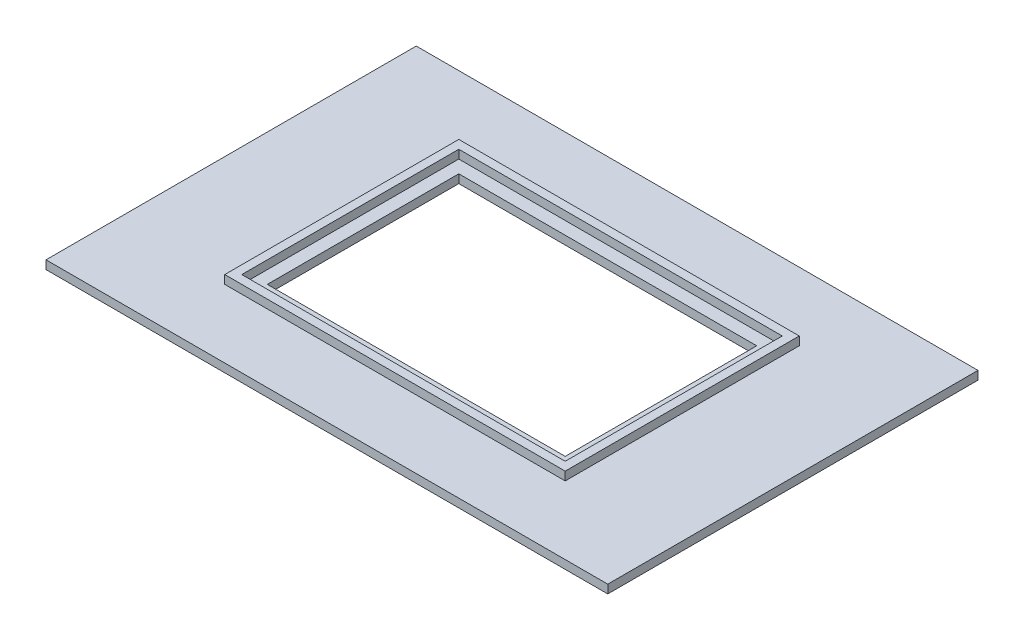
ISO-10303-21;
HEADER;
FILE_DESCRIPTION(('STEP AP214'),'2;1');
FILE_NAME('part.step','',(''),(''),'','','');
FILE_SCHEMA(('AUTOMOTIVE_DESIGN { 1 0 10303 214 1 1 1 1 }'));
ENDSEC;
DATA;
#1=APPLICATION_CONTEXT('core data for automotive mechanical design processes');
#2=APPLICATION_PROTOCOL_DEFINITION('international standard','automotive_design',2000,#1);
#3=PRODUCT_CONTEXT('',#1,'mechanical');
#4=PRODUCT('Part','Part','',(#3));
#5=PRODUCT_RELATED_PRODUCT_CATEGORY('part','',(#4));
#6=PRODUCT_DEFINITION_FORMATION('','',#4);
#7=PRODUCT_DEFINITION_CONTEXT('part definition',#1,'design');
#8=PRODUCT_DEFINITION('design','',#6,#7);
#9=PRODUCT_DEFINITION_SHAPE('','',#8);
#10=(LENGTH_UNIT() NAMED_UNIT(*) SI_UNIT(.MILLI.,.METRE.));
#11=(NAMED_UNIT(*) PLANE_ANGLE_UNIT() SI_UNIT($,.RADIAN.));
#12=(NAMED_UNIT(*) SI_UNIT($,.STERADIAN.) SOLID_ANGLE_UNIT());
#13=UNCERTAINTY_MEASURE_WITH_UNIT(LENGTH_MEASURE(1.E-05),#10,'distance_accuracy_value','');
#14=(GEOMETRIC_REPRESENTATION_CONTEXT(3) GLOBAL_UNCERTAINTY_ASSIGNED_CONTEXT((#13)) GLOBAL_UNIT_ASSIGNED_CONTEXT((#10,
#11,#12)) REPRESENTATION_CONTEXT('',''));
#15=CARTESIAN_POINT('',(0.,0.,0.));
#16=DIRECTION('',(0.,0.,1.));
#17=DIRECTION('',(1.,0.,0.));
#18=AXIS2_PLACEMENT_3D('',#15,#16,#17);
#19=CARTESIAN_POINT('',(0.,2.,0.));
#20=DIRECTION('',(0.,1.,0.));
#21=DIRECTION('',(0.,0.,1.));
#22=AXIS2_PLACEMENT_3D('',#19,#20,#21);
#23=PLANE('',#22);
#24=DIRECTION('',(0.,0.,1.));
#25=VECTOR('',#24,1.);
#26=CARTESIAN_POINT('',(-66.,2.,43.5));
#27=LINE('',#26,#25);
#28=CARTESIAN_POINT('',(-66.,2.,-43.5));
#29=VERTEX_POINT('',#28);
#30=CARTESIAN_POINT('',(-66.,2.,43.5));
#31=VERTEX_POINT('',#30);
#32=EDGE_CURVE('E235',#29,#31,#27,.T.);
#33=ORIENTED_EDGE('',*,*,#32,.T.);
#34=DIRECTION('',(1.,0.,0.));
#35=VECTOR('',#34,1.);
#36=CARTESIAN_POINT('',(66.,2.,43.5));
#37=LINE('',#36,#35);
#38=CARTESIAN_POINT('',(66.,2.,43.5));
#39=VERTEX_POINT('',#38);
#40=EDGE_CURVE('E238',#31,#39,#37,.T.);
#41=ORIENTED_EDGE('',*,*,#40,.T.);
#42=DIRECTION('',(0.,0.,-1.));
#43=VECTOR('',#42,1.);
#44=CARTESIAN_POINT('',(66.,2.,43.5));
#45=LINE('',#44,#43);
#46=CARTESIAN_POINT('',(66.,2.,-43.5));
#47=VERTEX_POINT('',#46);
#48=EDGE_CURVE('E241',#39,#47,#45,.T.);
#49=ORIENTED_EDGE('',*,*,#48,.T.);
#50=DIRECTION('',(-1.,0.,0.));
#51=VECTOR('',#50,1.);
#52=CARTESIAN_POINT('',(66.,2.,-43.5));
#53=LINE('',#52,#51);
#54=EDGE_CURVE('E243',#47,#29,#53,.T.);
#55=ORIENTED_EDGE('',*,*,#54,.T.);
#56=EDGE_LOOP('',(#33,#41,#49,#55));
#57=FACE_BOUND('',#56,.T.);
#58=DIRECTION('',(1.,0.,0.));
#59=VECTOR('',#58,1.);
#60=CARTESIAN_POINT('',(40.,2.,27.5));
#61=LINE('',#60,#59);
#62=CARTESIAN_POINT('',(-40.,2.,27.5));
#63=VERTEX_POINT('',#62);
#64=CARTESIAN_POINT('',(40.,2.,27.5));
#65=VERTEX_POINT('',#64);
#66=EDGE_CURVE('E219',#63,#65,#61,.T.);
#67=ORIENTED_EDGE('',*,*,#66,.F.);
#68=DIRECTION('',(0.,0.,1.));
#69=VECTOR('',#68,1.);
#70=CARTESIAN_POINT('',(-40.,2.,27.5));
#71=LINE('',#70,#69);
#72=CARTESIAN_POINT('',(-40.,2.,-27.5));
#73=VERTEX_POINT('',#72);
#74=EDGE_CURVE('E205',#73,#63,#71,.T.);
#75=ORIENTED_EDGE('',*,*,#74,.F.);
#76=DIRECTION('',(-1.,0.,0.));
#77=VECTOR('',#76,1.);
#78=CARTESIAN_POINT('',(40.,2.,-27.5));
#79=LINE('',#78,#77);
#80=CARTESIAN_POINT('',(40.,2.,-27.5));
#81=VERTEX_POINT('',#80);
#82=EDGE_CURVE('E210',#81,#73,#79,.T.);
#83=ORIENTED_EDGE('',*,*,#82,.F.);
#84=DIRECTION('',(0.,0.,-1.));
#85=VECTOR('',#84,1.);
#86=CARTESIAN_POINT('',(40.,2.,27.5));
#87=LINE('',#86,#85);
#88=EDGE_CURVE('E221',#65,#81,#87,.T.);
#89=ORIENTED_EDGE('',*,*,#88,.F.);
#90=EDGE_LOOP('',(#67,#75,#83,#89));
#91=FACE_BOUND('',#90,.T.);
#92=ADVANCED_FACE('F33',(#57,#91),#23,.T.);
#93=CARTESIAN_POINT('',(-66.,2.,43.5));
#94=DIRECTION('',(1.,0.,0.));
#95=DIRECTION('',(0.,0.,-1.));
#96=AXIS2_PLACEMENT_3D('',#93,#94,#95);
#97=PLANE('',#96);
#98=DIRECTION('',(0.,0.,1.));
#99=VECTOR('',#98,1.);
#100=CARTESIAN_POINT('',(-66.,0.,43.5));
#101=LINE('',#100,#99);
#102=CARTESIAN_POINT('',(-66.,0.,-43.5));
#103=VERTEX_POINT('',#102);
#104=CARTESIAN_POINT('',(-66.,0.,43.5));
#105=VERTEX_POINT('',#104);
#106=EDGE_CURVE('E234',#103,#105,#101,.T.);
#107=ORIENTED_EDGE('',*,*,#106,.T.);
#108=DIRECTION('',(0.,-1.,0.));
#109=VECTOR('',#108,1.);
#110=CARTESIAN_POINT('',(-66.,2.,43.5));
#111=LINE('',#110,#109);
#112=EDGE_CURVE('E11',#31,#105,#111,.T.);
#113=ORIENTED_EDGE('',*,*,#112,.F.);
#114=ORIENTED_EDGE('',*,*,#32,.F.);
#115=DIRECTION('',(0.,-1.,0.));
#116=VECTOR('',#115,1.);
#117=CARTESIAN_POINT('',(-66.,2.,-43.5));
#118=LINE('',#117,#116);
#119=EDGE_CURVE('E245',#29,#103,#118,.T.);
#120=ORIENTED_EDGE('',*,*,#119,.T.);
#121=EDGE_LOOP('',(#107,#113,#114,#120));
#122=FACE_BOUND('',#121,.T.);
#123=ADVANCED_FACE('F35',(#122),#97,.F.);
#124=CARTESIAN_POINT('',(66.,2.,43.5));
#125=DIRECTION('',(0.,0.,-1.));
#126=DIRECTION('',(-1.,0.,0.));
#127=AXIS2_PLACEMENT_3D('',#124,#125,#126);
#128=PLANE('',#127);
#129=DIRECTION('',(1.,0.,0.));
#130=VECTOR('',#129,1.);
#131=CARTESIAN_POINT('',(66.,0.,43.5));
#132=LINE('',#131,#130);
#133=CARTESIAN_POINT('',(66.,0.,43.5));
#134=VERTEX_POINT('',#133);
#135=EDGE_CURVE('E248',#105,#134,#132,.T.);
#136=ORIENTED_EDGE('',*,*,#135,.T.);
#137=DIRECTION('',(0.,-1.,0.));
#138=VECTOR('',#137,1.);
#139=CARTESIAN_POINT('',(66.,2.,43.5));
#140=LINE('',#139,#138);
#141=EDGE_CURVE('E41',#39,#134,#140,.T.);
#142=ORIENTED_EDGE('',*,*,#141,.F.);
#143=ORIENTED_EDGE('',*,*,#40,.F.);
#144=ORIENTED_EDGE('',*,*,#112,.T.);
#145=EDGE_LOOP('',(#136,#142,#143,#144));
#146=FACE_BOUND('',#145,.T.);
#147=ADVANCED_FACE('F278',(#146),#128,.F.);
#148=CARTESIAN_POINT('',(66.,2.,43.5));
#149=DIRECTION('',(-1.,0.,0.));
#150=DIRECTION('',(0.,0.,1.));
#151=AXIS2_PLACEMENT_3D('',#148,#149,#150);
#152=PLANE('',#151);
#153=DIRECTION('',(0.,0.,-1.));
#154=VECTOR('',#153,1.);
#155=CARTESIAN_POINT('',(66.,0.,43.5));
#156=LINE('',#155,#154);
#157=CARTESIAN_POINT('',(66.,0.,-43.5));
#158=VERTEX_POINT('',#157);
#159=EDGE_CURVE('E250',#134,#158,#156,.T.);
#160=ORIENTED_EDGE('',*,*,#159,.T.);
#161=DIRECTION('',(0.,-1.,0.));
#162=VECTOR('',#161,1.);
#163=CARTESIAN_POINT('',(66.,2.,-43.5));
#164=LINE('',#163,#162);
#165=EDGE_CURVE('E255',#47,#158,#164,.T.);
#166=ORIENTED_EDGE('',*,*,#165,.F.);
#167=ORIENTED_EDGE('',*,*,#48,.F.);
#168=ORIENTED_EDGE('',*,*,#141,.T.);
#169=EDGE_LOOP('',(#160,#166,#167,#168));
#170=FACE_BOUND('',#169,.T.);
#171=ADVANCED_FACE('F262',(#170),#152,.F.);
#172=CARTESIAN_POINT('',(66.,2.,-43.5));
#173=DIRECTION('',(0.,0.,1.));
#174=DIRECTION('',(1.,0.,0.));
#175=AXIS2_PLACEMENT_3D('',#172,#173,#174);
#176=PLANE('',#175);
#177=DIRECTION('',(-1.,0.,0.));
#178=VECTOR('',#177,1.);
#179=CARTESIAN_POINT('',(66.,0.,-43.5));
#180=LINE('',#179,#178);
#181=EDGE_CURVE('E239',#158,#103,#180,.T.);
#182=ORIENTED_EDGE('',*,*,#181,.T.);
#183=ORIENTED_EDGE('',*,*,#119,.F.);
#184=ORIENTED_EDGE('',*,*,#54,.F.);
#185=ORIENTED_EDGE('',*,*,#165,.T.);
#186=EDGE_LOOP('',(#182,#183,#184,#185));
#187=FACE_BOUND('',#186,.T.);
#188=ADVANCED_FACE('F271',(#187),#176,.F.);
#189=CARTESIAN_POINT('',(0.,0.,0.));
#190=DIRECTION('',(0.,1.,0.));
#191=DIRECTION('',(0.,0.,1.));
#192=AXIS2_PLACEMENT_3D('',#189,#190,#191);
#193=PLANE('',#192);
#194=DIRECTION('',(1.,0.,0.));
#195=VECTOR('',#194,1.);
#196=CARTESIAN_POINT('',(35.,0.,-22.5));
#197=LINE('',#196,#195);
#198=CARTESIAN_POINT('',(-35.,0.,-22.5));
#199=VERTEX_POINT('',#198);
#200=CARTESIAN_POINT('',(35.,0.,-22.5));
#201=VERTEX_POINT('',#200);
#202=EDGE_CURVE('E461',#199,#201,#197,.T.);
#203=ORIENTED_EDGE('',*,*,#202,.F.);
#204=DIRECTION('',(0.,0.,-1.));
#205=VECTOR('',#204,1.);
#206=CARTESIAN_POINT('',(-35.,0.,22.5));
#207=LINE('',#206,#205);
#208=CARTESIAN_POINT('',(-35.,0.,22.5));
#209=VERTEX_POINT('',#208);
#210=EDGE_CURVE('E177',#209,#199,#207,.T.);
#211=ORIENTED_EDGE('',*,*,#210,.F.);
#212=DIRECTION('',(-1.,0.,0.));
#213=VECTOR('',#212,1.);
#214=CARTESIAN_POINT('',(35.,0.,22.5));
#215=LINE('',#214,#213);
#216=CARTESIAN_POINT('',(35.,0.,22.5));
#217=VERTEX_POINT('',#216);
#218=EDGE_CURVE('E174',#217,#209,#215,.T.);
#219=ORIENTED_EDGE('',*,*,#218,.F.);
#220=DIRECTION('',(0.,0.,1.));
#221=VECTOR('',#220,1.);
#222=CARTESIAN_POINT('',(35.,0.,22.5));
#223=LINE('',#222,#221);
#224=EDGE_CURVE('E152',#201,#217,#223,.T.);
#225=ORIENTED_EDGE('',*,*,#224,.F.);
#226=EDGE_LOOP('',(#203,#211,#219,#225));
#227=FACE_BOUND('',#226,.T.);
#228=ORIENTED_EDGE('',*,*,#106,.F.);
#229=ORIENTED_EDGE('',*,*,#181,.F.);
#230=ORIENTED_EDGE('',*,*,#159,.F.);
#231=ORIENTED_EDGE('',*,*,#135,.F.);
#232=EDGE_LOOP('',(#228,#229,#230,#231));
#233=FACE_BOUND('',#232,.T.);
#234=ADVANCED_FACE('F268',(#227,#233),#193,.F.);
#235=CARTESIAN_POINT('',(-40.,4.,27.5));
#236=DIRECTION('',(1.,0.,0.));
#237=DIRECTION('',(0.,0.,-1.));
#238=AXIS2_PLACEMENT_3D('',#235,#236,#237);
#239=PLANE('',#238);
#240=ORIENTED_EDGE('',*,*,#74,.T.);
#241=DIRECTION('',(0.,-1.,0.));
#242=VECTOR('',#241,1.);
#243=CARTESIAN_POINT('',(-40.,4.,27.5));
#244=LINE('',#243,#242);
#245=CARTESIAN_POINT('',(-40.,4.,27.5));
#246=VERTEX_POINT('',#245);
#247=EDGE_CURVE('E232',#246,#63,#244,.T.);
#248=ORIENTED_EDGE('',*,*,#247,.F.);
#249=DIRECTION('',(0.,0.,1.));
#250=VECTOR('',#249,1.);
#251=CARTESIAN_POINT('',(-40.,4.,27.5));
#252=LINE('',#251,#250);
#253=CARTESIAN_POINT('',(-40.,4.,-27.5));
#254=VERTEX_POINT('',#253);
#255=EDGE_CURVE('E206',#254,#246,#252,.T.);
#256=ORIENTED_EDGE('',*,*,#255,.F.);
#257=DIRECTION('',(0.,-1.,0.));
#258=VECTOR('',#257,1.);
#259=CARTESIAN_POINT('',(-40.,4.,-27.5));
#260=LINE('',#259,#258);
#261=EDGE_CURVE('E216',#254,#73,#260,.T.);
#262=ORIENTED_EDGE('',*,*,#261,.T.);
#263=EDGE_LOOP('',(#240,#248,#256,#262));
#264=FACE_BOUND('',#263,.T.);
#265=ADVANCED_FACE('F291',(#264),#239,.F.);
#266=CARTESIAN_POINT('',(40.,4.,27.5));
#267=DIRECTION('',(0.,0.,-1.));
#268=DIRECTION('',(-1.,0.,0.));
#269=AXIS2_PLACEMENT_3D('',#266,#267,#268);
#270=PLANE('',#269);
#271=ORIENTED_EDGE('',*,*,#66,.T.);
#272=DIRECTION('',(0.,-1.,0.));
#273=VECTOR('',#272,1.);
#274=CARTESIAN_POINT('',(40.,4.,27.5));
#275=LINE('',#274,#273);
#276=CARTESIAN_POINT('',(40.,4.,27.5));
#277=VERTEX_POINT('',#276);
#278=EDGE_CURVE('E229',#277,#65,#275,.T.);
#279=ORIENTED_EDGE('',*,*,#278,.F.);
#280=DIRECTION('',(1.,0.,0.));
#281=VECTOR('',#280,1.);
#282=CARTESIAN_POINT('',(40.,4.,27.5));
#283=LINE('',#282,#281);
#284=EDGE_CURVE('E209',#246,#277,#283,.T.);
#285=ORIENTED_EDGE('',*,*,#284,.F.);
#286=ORIENTED_EDGE('',*,*,#247,.T.);
#287=EDGE_LOOP('',(#271,#279,#285,#286));
#288=FACE_BOUND('',#287,.T.);
#289=ADVANCED_FACE('F313',(#288),#270,.F.);
#290=CARTESIAN_POINT('',(40.,4.,27.5));
#291=DIRECTION('',(-1.,0.,0.));
#292=DIRECTION('',(0.,0.,1.));
#293=AXIS2_PLACEMENT_3D('',#290,#291,#292);
#294=PLANE('',#293);
#295=ORIENTED_EDGE('',*,*,#88,.T.);
#296=DIRECTION('',(0.,-1.,0.));
#297=VECTOR('',#296,1.);
#298=CARTESIAN_POINT('',(40.,4.,-27.5));
#299=LINE('',#298,#297);
#300=CARTESIAN_POINT('',(40.,4.,-27.5));
#301=VERTEX_POINT('',#300);
#302=EDGE_CURVE('E227',#301,#81,#299,.T.);
#303=ORIENTED_EDGE('',*,*,#302,.F.);
#304=DIRECTION('',(0.,0.,-1.));
#305=VECTOR('',#304,1.);
#306=CARTESIAN_POINT('',(40.,4.,27.5));
#307=LINE('',#306,#305);
#308=EDGE_CURVE('E212',#277,#301,#307,.T.);
#309=ORIENTED_EDGE('',*,*,#308,.F.);
#310=ORIENTED_EDGE('',*,*,#278,.T.);
#311=EDGE_LOOP('',(#295,#303,#309,#310));
#312=FACE_BOUND('',#311,.T.);
#313=ADVANCED_FACE('F320',(#312),#294,.F.);
#314=CARTESIAN_POINT('',(40.,4.,-27.5));
#315=DIRECTION('',(0.,0.,1.));
#316=DIRECTION('',(1.,0.,0.));
#317=AXIS2_PLACEMENT_3D('',#314,#315,#316);
#318=PLANE('',#317);
#319=ORIENTED_EDGE('',*,*,#82,.T.);
#320=ORIENTED_EDGE('',*,*,#261,.F.);
#321=DIRECTION('',(-1.,0.,0.));
#322=VECTOR('',#321,1.);
#323=CARTESIAN_POINT('',(40.,4.,-27.5));
#324=LINE('',#323,#322);
#325=EDGE_CURVE('E214',#301,#254,#324,.T.);
#326=ORIENTED_EDGE('',*,*,#325,.F.);
#327=ORIENTED_EDGE('',*,*,#302,.T.);
#328=EDGE_LOOP('',(#319,#320,#326,#327));
#329=FACE_BOUND('',#328,.T.);
#330=ADVANCED_FACE('F327',(#329),#318,.F.);
#331=CARTESIAN_POINT('',(0.,4.,0.));
#332=DIRECTION('',(0.,1.,0.));
#333=DIRECTION('',(0.,0.,1.));
#334=AXIS2_PLACEMENT_3D('',#331,#332,#333);
#335=PLANE('',#334);
#336=DIRECTION('',(0.,0.,1.));
#337=VECTOR('',#336,1.);
#338=CARTESIAN_POINT('',(-38.,4.,25.5));
#339=LINE('',#338,#337);
#340=CARTESIAN_POINT('',(-38.,4.,-25.5));
#341=VERTEX_POINT('',#340);
#342=CARTESIAN_POINT('',(-38.,4.,25.5));
#343=VERTEX_POINT('',#342);
#344=EDGE_CURVE('E176',#341,#343,#339,.T.);
#345=ORIENTED_EDGE('',*,*,#344,.F.);
#346=DIRECTION('',(-1.,0.,0.));
#347=VECTOR('',#346,1.);
#348=CARTESIAN_POINT('',(38.,4.,-25.5));
#349=LINE('',#348,#347);
#350=CARTESIAN_POINT('',(38.,4.,-25.5));
#351=VERTEX_POINT('',#350);
#352=EDGE_CURVE('E193',#351,#341,#349,.T.);
#353=ORIENTED_EDGE('',*,*,#352,.F.);
#354=DIRECTION('',(0.,0.,-1.));
#355=VECTOR('',#354,1.);
#356=CARTESIAN_POINT('',(38.,4.,25.5));
#357=LINE('',#356,#355);
#358=CARTESIAN_POINT('',(38.,4.,25.5));
#359=VERTEX_POINT('',#358);
#360=EDGE_CURVE('E190',#359,#351,#357,.T.);
#361=ORIENTED_EDGE('',*,*,#360,.F.);
#362=DIRECTION('',(1.,0.,0.));
#363=VECTOR('',#362,1.);
#364=CARTESIAN_POINT('',(38.,4.,25.5));
#365=LINE('',#364,#363);
#366=EDGE_CURVE('E187',#343,#359,#365,.T.);
#367=ORIENTED_EDGE('',*,*,#366,.F.);
#368=EDGE_LOOP('',(#345,#353,#361,#367));
#369=FACE_BOUND('',#368,.T.);
#370=ORIENTED_EDGE('',*,*,#255,.T.);
#371=ORIENTED_EDGE('',*,*,#284,.T.);
#372=ORIENTED_EDGE('',*,*,#308,.T.);
#373=ORIENTED_EDGE('',*,*,#325,.T.);
#374=EDGE_LOOP('',(#370,#371,#372,#373));
#375=FACE_BOUND('',#374,.T.);
#376=ADVANCED_FACE('F335',(#369,#375),#335,.T.);
#377=CARTESIAN_POINT('',(-38.,-89.5259526036195,25.5));
#378=DIRECTION('',(-1.,0.,0.));
#379=DIRECTION('',(0.,0.,1.));
#380=AXIS2_PLACEMENT_3D('',#377,#378,#379);
#381=PLANE('',#380);
#382=DIRECTION('',(0.,0.,-1.));
#383=VECTOR('',#382,1.);
#384=CARTESIAN_POINT('',(-38.,2.,25.5));
#385=LINE('',#384,#383);
#386=CARTESIAN_POINT('',(-38.,2.,25.5));
#387=VERTEX_POINT('',#386);
#388=CARTESIAN_POINT('',(-38.,2.,-25.5));
#389=VERTEX_POINT('',#388);
#390=EDGE_CURVE('E183',#387,#389,#385,.T.);
#391=ORIENTED_EDGE('',*,*,#390,.T.);
#392=DIRECTION('',(0.,1.,0.));
#393=VECTOR('',#392,1.);
#394=CARTESIAN_POINT('',(-38.,-89.5259526036195,-25.5));
#395=LINE('',#394,#393);
#396=EDGE_CURVE('E181',#389,#341,#395,.T.);
#397=ORIENTED_EDGE('',*,*,#396,.T.);
#398=ORIENTED_EDGE('',*,*,#344,.T.);
#399=DIRECTION('',(0.,1.,0.));
#400=VECTOR('',#399,1.);
#401=CARTESIAN_POINT('',(-38.,-89.5259526036195,25.5));
#402=LINE('',#401,#400);
#403=EDGE_CURVE('E196',#387,#343,#402,.T.);
#404=ORIENTED_EDGE('',*,*,#403,.F.);
#405=EDGE_LOOP('',(#391,#397,#398,#404));
#406=FACE_BOUND('',#405,.T.);
#407=ADVANCED_FACE('F343',(#406),#381,.F.);
#408=CARTESIAN_POINT('',(38.,-89.5259526036195,-25.5));
#409=DIRECTION('',(0.,0.,-1.));
#410=DIRECTION('',(-1.,0.,0.));
#411=AXIS2_PLACEMENT_3D('',#408,#409,#410);
#412=PLANE('',#411);
#413=DIRECTION('',(1.,0.,0.));
#414=VECTOR('',#413,1.);
#415=CARTESIAN_POINT('',(38.,2.,-25.5));
#416=LINE('',#415,#414);
#417=CARTESIAN_POINT('',(38.,2.,-25.5));
#418=VERTEX_POINT('',#417);
#419=EDGE_CURVE('E180',#389,#418,#416,.T.);
#420=ORIENTED_EDGE('',*,*,#419,.T.);
#421=DIRECTION('',(0.,1.,0.));
#422=VECTOR('',#421,1.);
#423=CARTESIAN_POINT('',(38.,-89.5259526036195,-25.5));
#424=LINE('',#423,#422);
#425=EDGE_CURVE('E198',#418,#351,#424,.T.);
#426=ORIENTED_EDGE('',*,*,#425,.T.);
#427=ORIENTED_EDGE('',*,*,#352,.T.);
#428=ORIENTED_EDGE('',*,*,#396,.F.);
#429=EDGE_LOOP('',(#420,#426,#427,#428));
#430=FACE_BOUND('',#429,.T.);
#431=ADVANCED_FACE('F351',(#430),#412,.F.);
#432=CARTESIAN_POINT('',(38.,-89.5259526036195,25.5));
#433=DIRECTION('',(1.,0.,0.));
#434=DIRECTION('',(0.,0.,-1.));
#435=AXIS2_PLACEMENT_3D('',#432,#433,#434);
#436=PLANE('',#435);
#437=DIRECTION('',(0.,0.,1.));
#438=VECTOR('',#437,1.);
#439=CARTESIAN_POINT('',(38.,2.,25.5));
#440=LINE('',#439,#438);
#441=CARTESIAN_POINT('',(38.,2.,25.5));
#442=VERTEX_POINT('',#441);
#443=EDGE_CURVE('E178',#418,#442,#440,.T.);
#444=ORIENTED_EDGE('',*,*,#443,.T.);
#445=DIRECTION('',(0.,1.,0.));
#446=VECTOR('',#445,1.);
#447=CARTESIAN_POINT('',(38.,-89.5259526036195,25.5));
#448=LINE('',#447,#446);
#449=EDGE_CURVE('E200',#442,#359,#448,.T.);
#450=ORIENTED_EDGE('',*,*,#449,.T.);
#451=ORIENTED_EDGE('',*,*,#360,.T.);
#452=ORIENTED_EDGE('',*,*,#425,.F.);
#453=EDGE_LOOP('',(#444,#450,#451,#452));
#454=FACE_BOUND('',#453,.T.);
#455=ADVANCED_FACE('F359',(#454),#436,.F.);
#456=CARTESIAN_POINT('',(38.,-89.5259526036195,25.5));
#457=DIRECTION('',(0.,0.,1.));
#458=DIRECTION('',(1.,0.,0.));
#459=AXIS2_PLACEMENT_3D('',#456,#457,#458);
#460=PLANE('',#459);
#461=DIRECTION('',(-1.,0.,0.));
#462=VECTOR('',#461,1.);
#463=CARTESIAN_POINT('',(38.,2.,25.5));
#464=LINE('',#463,#462);
#465=EDGE_CURVE('E185',#442,#387,#464,.T.);
#466=ORIENTED_EDGE('',*,*,#465,.T.);
#467=ORIENTED_EDGE('',*,*,#403,.T.);
#468=ORIENTED_EDGE('',*,*,#366,.T.);
#469=ORIENTED_EDGE('',*,*,#449,.F.);
#470=EDGE_LOOP('',(#466,#467,#468,#469));
#471=FACE_BOUND('',#470,.T.);
#472=ADVANCED_FACE('F367',(#471),#460,.F.);
#473=CARTESIAN_POINT('',(0.,2.,0.));
#474=DIRECTION('',(0.,1.,0.));
#475=DIRECTION('',(0.,0.,1.));
#476=AXIS2_PLACEMENT_3D('',#473,#474,#475);
#477=PLANE('',#476);
#478=DIRECTION('',(0.,0.,1.));
#479=VECTOR('',#478,1.);
#480=CARTESIAN_POINT('',(-35.,2.,22.5));
#481=LINE('',#480,#479);
#482=CARTESIAN_POINT('',(-35.,2.,-22.5));
#483=VERTEX_POINT('',#482);
#484=CARTESIAN_POINT('',(-35.,2.,22.5));
#485=VERTEX_POINT('',#484);
#486=EDGE_CURVE('E56',#483,#485,#481,.T.);
#487=ORIENTED_EDGE('',*,*,#486,.F.);
#488=DIRECTION('',(-1.,0.,0.));
#489=VECTOR('',#488,1.);
#490=CARTESIAN_POINT('',(35.,2.,-22.5));
#491=LINE('',#490,#489);
#492=CARTESIAN_POINT('',(35.,2.,-22.5));
#493=VERTEX_POINT('',#492);
#494=EDGE_CURVE('E165',#493,#483,#491,.T.);
#495=ORIENTED_EDGE('',*,*,#494,.F.);
#496=DIRECTION('',(0.,0.,-1.));
#497=VECTOR('',#496,1.);
#498=CARTESIAN_POINT('',(35.,2.,22.5));
#499=LINE('',#498,#497);
#500=CARTESIAN_POINT('',(35.,2.,22.5));
#501=VERTEX_POINT('',#500);
#502=EDGE_CURVE('E149',#501,#493,#499,.T.);
#503=ORIENTED_EDGE('',*,*,#502,.F.);
#504=DIRECTION('',(1.,0.,0.));
#505=VECTOR('',#504,1.);
#506=CARTESIAN_POINT('',(35.,2.,22.5));
#507=LINE('',#506,#505);
#508=EDGE_CURVE('E158',#485,#501,#507,.T.);
#509=ORIENTED_EDGE('',*,*,#508,.F.);
#510=EDGE_LOOP('',(#487,#495,#503,#509));
#511=FACE_BOUND('',#510,.T.);
#512=ORIENTED_EDGE('',*,*,#390,.F.);
#513=ORIENTED_EDGE('',*,*,#465,.F.);
#514=ORIENTED_EDGE('',*,*,#443,.F.);
#515=ORIENTED_EDGE('',*,*,#419,.F.);
#516=EDGE_LOOP('',(#512,#513,#514,#515));
#517=FACE_BOUND('',#516,.T.);
#518=ADVANCED_FACE('F162',(#511,#517),#477,.T.);
#519=CARTESIAN_POINT('',(-35.,-83.2165848854662,22.5));
#520=DIRECTION('',(-1.,0.,0.));
#521=DIRECTION('',(0.,0.,1.));
#522=AXIS2_PLACEMENT_3D('',#519,#520,#521);
#523=PLANE('',#522);
#524=ORIENTED_EDGE('',*,*,#210,.T.);
#525=DIRECTION('',(0.,1.,0.));
#526=VECTOR('',#525,1.);
#527=CARTESIAN_POINT('',(-35.,-83.2165848854662,-22.5));
#528=LINE('',#527,#526);
#529=EDGE_CURVE('E170',#199,#483,#528,.T.);
#530=ORIENTED_EDGE('',*,*,#529,.T.);
#531=ORIENTED_EDGE('',*,*,#486,.T.);
#532=DIRECTION('',(0.,1.,0.));
#533=VECTOR('',#532,1.);
#534=CARTESIAN_POINT('',(-35.,-83.2165848854662,22.5));
#535=LINE('',#534,#533);
#536=EDGE_CURVE('E155',#209,#485,#535,.T.);
#537=ORIENTED_EDGE('',*,*,#536,.F.);
#538=EDGE_LOOP('',(#524,#530,#531,#537));
#539=FACE_BOUND('',#538,.T.);
#540=ADVANCED_FACE('F380',(#539),#523,.F.);
#541=CARTESIAN_POINT('',(35.,-83.2165848854662,-22.5));
#542=DIRECTION('',(0.,0.,-1.));
#543=DIRECTION('',(-1.,0.,0.));
#544=AXIS2_PLACEMENT_3D('',#541,#542,#543);
#545=PLANE('',#544);
#546=ORIENTED_EDGE('',*,*,#202,.T.);
#547=DIRECTION('',(0.,1.,0.));
#548=VECTOR('',#547,1.);
#549=CARTESIAN_POINT('',(35.,-83.2165848854662,-22.5));
#550=LINE('',#549,#548);
#551=EDGE_CURVE('E154',#201,#493,#550,.T.);
#552=ORIENTED_EDGE('',*,*,#551,.T.);
#553=ORIENTED_EDGE('',*,*,#494,.T.);
#554=ORIENTED_EDGE('',*,*,#529,.F.);
#555=EDGE_LOOP('',(#546,#552,#553,#554));
#556=FACE_BOUND('',#555,.T.);
#557=ADVANCED_FACE('F387',(#556),#545,.F.);
#558=CARTESIAN_POINT('',(35.,-83.2165848854662,22.5));
#559=DIRECTION('',(1.,0.,0.));
#560=DIRECTION('',(0.,0.,-1.));
#561=AXIS2_PLACEMENT_3D('',#558,#559,#560);
#562=PLANE('',#561);
#563=ORIENTED_EDGE('',*,*,#224,.T.);
#564=DIRECTION('',(0.,1.,0.));
#565=VECTOR('',#564,1.);
#566=CARTESIAN_POINT('',(35.,-83.2165848854662,22.5));
#567=LINE('',#566,#565);
#568=EDGE_CURVE('E48',#217,#501,#567,.T.);
#569=ORIENTED_EDGE('',*,*,#568,.T.);
#570=ORIENTED_EDGE('',*,*,#502,.T.);
#571=ORIENTED_EDGE('',*,*,#551,.F.);
#572=EDGE_LOOP('',(#563,#569,#570,#571));
#573=FACE_BOUND('',#572,.T.);
#574=ADVANCED_FACE('F146',(#573),#562,.F.);
#575=CARTESIAN_POINT('',(35.,-83.2165848854662,22.5));
#576=DIRECTION('',(0.,0.,1.));
#577=DIRECTION('',(1.,0.,0.));
#578=AXIS2_PLACEMENT_3D('',#575,#576,#577);
#579=PLANE('',#578);
#580=ORIENTED_EDGE('',*,*,#218,.T.);
#581=ORIENTED_EDGE('',*,*,#536,.T.);
#582=ORIENTED_EDGE('',*,*,#508,.T.);
#583=ORIENTED_EDGE('',*,*,#568,.F.);
#584=EDGE_LOOP('',(#580,#581,#582,#583));
#585=FACE_BOUND('',#584,.T.);
#586=ADVANCED_FACE('F159',(#585),#579,.F.);
#587=CLOSED_SHELL('',(#92,#123,#147,#171,#188,#234,#265,#289,#313,#330,#376,#407,#431,#455,#472,
#518,#540,#557,#574,#586));
#588=MANIFOLD_SOLID_BREP('B2',#587);
#589=ADVANCED_BREP_SHAPE_REPRESENTATION('',(#18,#588),#14);
#590=SHAPE_DEFINITION_REPRESENTATION(#9,#589);
ENDSEC;
END-ISO-10303-21;
